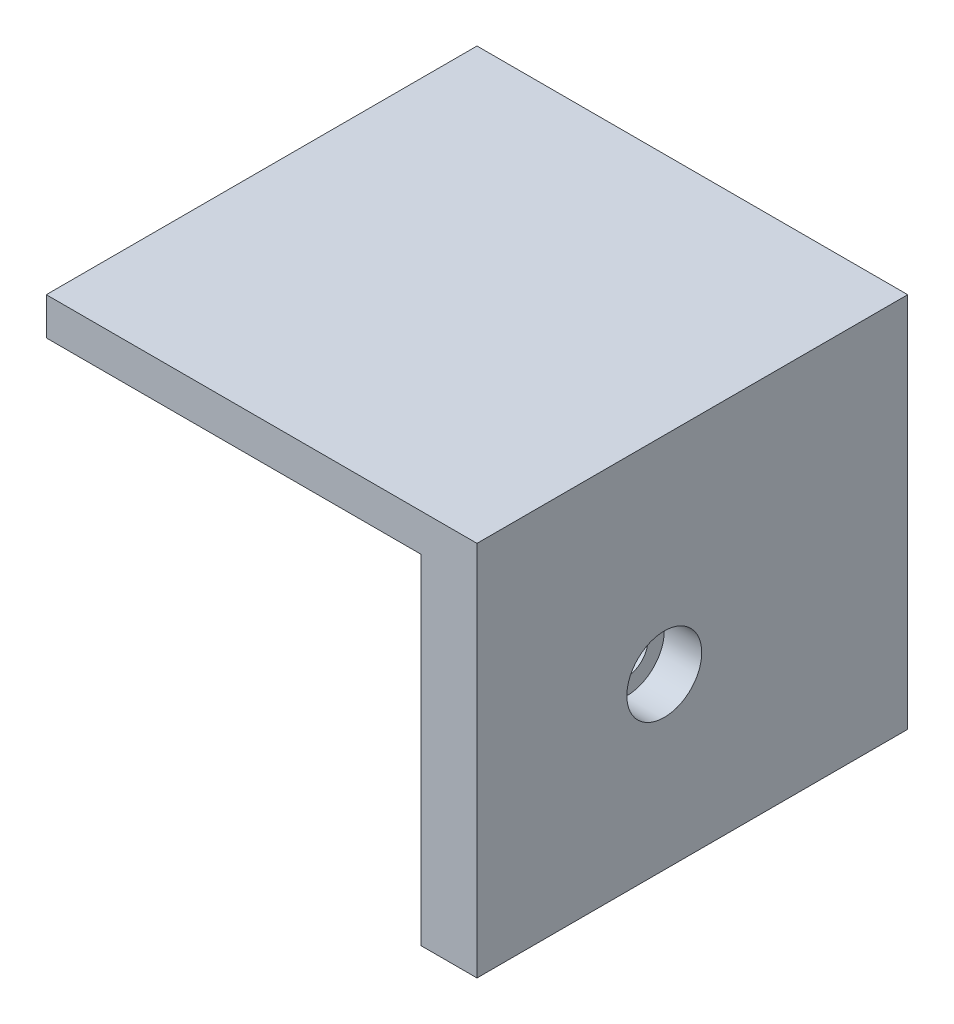
ISO-10303-21;
HEADER;
FILE_DESCRIPTION(('STEP AP214'),'2;1');
FILE_NAME('part.step','',(''),(''),'','','');
FILE_SCHEMA(('AUTOMOTIVE_DESIGN { 1 0 10303 214 1 1 1 1 }'));
ENDSEC;
DATA;
#1=APPLICATION_CONTEXT('core data for automotive mechanical design processes');
#2=APPLICATION_PROTOCOL_DEFINITION('international standard','automotive_design',2000,#1);
#3=PRODUCT_CONTEXT('',#1,'mechanical');
#4=PRODUCT('Part','Part','',(#3));
#5=PRODUCT_RELATED_PRODUCT_CATEGORY('part','',(#4));
#6=PRODUCT_DEFINITION_FORMATION('','',#4);
#7=PRODUCT_DEFINITION_CONTEXT('part definition',#1,'design');
#8=PRODUCT_DEFINITION('design','',#6,#7);
#9=PRODUCT_DEFINITION_SHAPE('','',#8);
#10=(LENGTH_UNIT() NAMED_UNIT(*) SI_UNIT(.MILLI.,.METRE.));
#11=(NAMED_UNIT(*) PLANE_ANGLE_UNIT() SI_UNIT($,.RADIAN.));
#12=(NAMED_UNIT(*) SI_UNIT($,.STERADIAN.) SOLID_ANGLE_UNIT());
#13=UNCERTAINTY_MEASURE_WITH_UNIT(LENGTH_MEASURE(1.E-05),#10,'distance_accuracy_value','');
#14=(GEOMETRIC_REPRESENTATION_CONTEXT(3) GLOBAL_UNCERTAINTY_ASSIGNED_CONTEXT((#13)) GLOBAL_UNIT_ASSIGNED_CONTEXT((#10,
#11,#12)) REPRESENTATION_CONTEXT('',''));
#15=CARTESIAN_POINT('',(0.,0.,0.));
#16=DIRECTION('',(0.,0.,1.));
#17=DIRECTION('',(1.,0.,0.));
#18=AXIS2_PLACEMENT_3D('',#15,#16,#17);
#19=CARTESIAN_POINT('',(0.,36.2,-6.));
#20=DIRECTION('',(0.,0.,1.));
#21=DIRECTION('',(1.,0.,0.));
#22=AXIS2_PLACEMENT_3D('',#19,#20,#21);
#23=PLANE('',#22);
#24=CARTESIAN_POINT('',(-20.,18.1,-6.));
#25=DIRECTION('',(0.,0.,-1.));
#26=DIRECTION('',(-1.,0.,0.));
#27=AXIS2_PLACEMENT_3D('',#24,#25,#26);
#28=CIRCLE('',#27,3.99999999999999);
#29=CARTESIAN_POINT('',(-24.,18.1,-6.));
#30=VERTEX_POINT('',#29);
#31=EDGE_CURVE('E189',#30,#30,#28,.T.);
#32=ORIENTED_EDGE('',*,*,#31,.F.);
#33=EDGE_LOOP('',(#32));
#34=FACE_BOUND('',#33,.T.);
#35=DIRECTION('',(1.,0.,0.));
#36=VECTOR('',#35,1.);
#37=CARTESIAN_POINT('',(0.,0.,-6.));
#38=LINE('',#37,#36);
#39=CARTESIAN_POINT('',(6.,0.,-6.));
#40=VERTEX_POINT('',#39);
#41=CARTESIAN_POINT('',(-40.,0.,-6.));
#42=VERTEX_POINT('',#41);
#43=EDGE_CURVE('E108',#40,#42,#38,.F.);
#44=ORIENTED_EDGE('',*,*,#43,.T.);
#45=DIRECTION('',(0.,-1.,0.));
#46=VECTOR('',#45,1.);
#47=CARTESIAN_POINT('',(-40.,36.2,-6.));
#48=LINE('',#47,#46);
#49=CARTESIAN_POINT('',(-40.,40.2,-5.99999999999999));
#50=VERTEX_POINT('',#49);
#51=EDGE_CURVE('E11',#50,#42,#48,.T.);
#52=ORIENTED_EDGE('',*,*,#51,.F.);
#53=DIRECTION('',(-1.,0.,0.));
#54=VECTOR('',#53,1.);
#55=CARTESIAN_POINT('',(6.,40.2,-6.));
#56=LINE('',#55,#54);
#57=CARTESIAN_POINT('',(6.,40.2,-6.));
#58=VERTEX_POINT('',#57);
#59=EDGE_CURVE('E172',#58,#50,#56,.T.);
#60=ORIENTED_EDGE('',*,*,#59,.F.);
#61=DIRECTION('',(0.,-1.,0.));
#62=VECTOR('',#61,1.);
#63=CARTESIAN_POINT('',(6.,36.2,-6.));
#64=LINE('',#63,#62);
#65=EDGE_CURVE('E98',#58,#40,#64,.T.);
#66=ORIENTED_EDGE('',*,*,#65,.T.);
#67=EDGE_LOOP('',(#44,#52,#60,#66));
#68=FACE_BOUND('',#67,.T.);
#69=ADVANCED_FACE('F45',(#34,#68),#23,.F.);
#70=CARTESIAN_POINT('',(-40.,36.2,0.));
#71=DIRECTION('',(-1.,0.,0.));
#72=DIRECTION('',(0.,0.,1.));
#73=AXIS2_PLACEMENT_3D('',#70,#71,#72);
#74=PLANE('',#73);
#75=DIRECTION('',(0.,0.,-1.));
#76=VECTOR('',#75,1.);
#77=CARTESIAN_POINT('',(-40.,0.,0.));
#78=LINE('',#77,#76);
#79=CARTESIAN_POINT('',(-40.,0.,0.));
#80=VERTEX_POINT('',#79);
#81=EDGE_CURVE('E139',#80,#42,#78,.T.);
#82=ORIENTED_EDGE('',*,*,#81,.F.);
#83=DIRECTION('',(0.,-1.,0.));
#84=VECTOR('',#83,1.);
#85=CARTESIAN_POINT('',(-40.,36.2,0.));
#86=LINE('',#85,#84);
#87=CARTESIAN_POINT('',(-40.,36.2,0.));
#88=VERTEX_POINT('',#87);
#89=EDGE_CURVE('E54',#88,#80,#86,.T.);
#90=ORIENTED_EDGE('',*,*,#89,.F.);
#91=DIRECTION('',(0.,0.,1.));
#92=VECTOR('',#91,1.);
#93=CARTESIAN_POINT('',(-40.,36.2,-5.99999999999999));
#94=LINE('',#93,#92);
#95=CARTESIAN_POINT('',(-40.,36.2,40.));
#96=VERTEX_POINT('',#95);
#97=EDGE_CURVE('E162',#88,#96,#94,.T.);
#98=ORIENTED_EDGE('',*,*,#97,.T.);
#99=DIRECTION('',(0.,-1.,0.));
#100=VECTOR('',#99,1.);
#101=CARTESIAN_POINT('',(-40.,40.2,40.));
#102=LINE('',#101,#100);
#103=CARTESIAN_POINT('',(-40.,40.2,40.));
#104=VERTEX_POINT('',#103);
#105=EDGE_CURVE('E149',#104,#96,#102,.T.);
#106=ORIENTED_EDGE('',*,*,#105,.F.);
#107=DIRECTION('',(0.,0.,1.));
#108=VECTOR('',#107,1.);
#109=CARTESIAN_POINT('',(-40.,40.2,-5.99999999999999));
#110=LINE('',#109,#108);
#111=EDGE_CURVE('E168',#50,#104,#110,.T.);
#112=ORIENTED_EDGE('',*,*,#111,.F.);
#113=ORIENTED_EDGE('',*,*,#51,.T.);
#114=EDGE_LOOP('',(#82,#90,#98,#106,#112,#113));
#115=FACE_BOUND('',#114,.T.);
#116=ADVANCED_FACE('F140',(#115),#74,.T.);
#117=CARTESIAN_POINT('',(0.,36.2,0.));
#118=DIRECTION('',(0.,0.,1.));
#119=DIRECTION('',(1.,0.,0.));
#120=AXIS2_PLACEMENT_3D('',#117,#118,#119);
#121=PLANE('',#120);
#122=CARTESIAN_POINT('',(-20.,18.1,0.));
#123=DIRECTION('',(0.,0.,1.));
#124=DIRECTION('',(1.,0.,0.));
#125=AXIS2_PLACEMENT_3D('',#122,#123,#124);
#126=CIRCLE('',#125,2.25);
#127=CARTESIAN_POINT('',(-17.75,18.1,0.));
#128=VERTEX_POINT('',#127);
#129=EDGE_CURVE('E165',#128,#128,#126,.T.);
#130=ORIENTED_EDGE('',*,*,#129,.F.);
#131=EDGE_LOOP('',(#130));
#132=FACE_BOUND('',#131,.T.);
#133=DIRECTION('',(-1.,0.,0.));
#134=VECTOR('',#133,1.);
#135=CARTESIAN_POINT('',(0.,0.,0.));
#136=LINE('',#135,#134);
#137=CARTESIAN_POINT('',(0.,0.,0.));
#138=VERTEX_POINT('',#137);
#139=EDGE_CURVE('E119',#138,#80,#136,.T.);
#140=ORIENTED_EDGE('',*,*,#139,.F.);
#141=DIRECTION('',(0.,-1.,0.));
#142=VECTOR('',#141,1.);
#143=CARTESIAN_POINT('',(0.,36.2,0.));
#144=LINE('',#143,#142);
#145=CARTESIAN_POINT('',(0.,36.2,0.));
#146=VERTEX_POINT('',#145);
#147=EDGE_CURVE('E128',#146,#138,#144,.T.);
#148=ORIENTED_EDGE('',*,*,#147,.F.);
#149=DIRECTION('',(-1.,0.,0.));
#150=VECTOR('',#149,1.);
#151=CARTESIAN_POINT('',(0.,36.2,0.));
#152=LINE('',#151,#150);
#153=EDGE_CURVE('E61',#146,#88,#152,.T.);
#154=ORIENTED_EDGE('',*,*,#153,.T.);
#155=ORIENTED_EDGE('',*,*,#89,.T.);
#156=EDGE_LOOP('',(#140,#148,#154,#155));
#157=FACE_BOUND('',#156,.T.);
#158=ADVANCED_FACE('F135',(#132,#157),#121,.T.);
#159=CARTESIAN_POINT('',(0.,36.2,0.));
#160=DIRECTION('',(-1.,0.,0.));
#161=DIRECTION('',(0.,0.,1.));
#162=AXIS2_PLACEMENT_3D('',#159,#160,#161);
#163=PLANE('',#162);
#164=CARTESIAN_POINT('',(0.,18.1,20.));
#165=DIRECTION('',(-1.,0.,0.));
#166=DIRECTION('',(0.,0.,1.));
#167=AXIS2_PLACEMENT_3D('',#164,#165,#166);
#168=CIRCLE('',#167,2.25);
#169=CARTESIAN_POINT('',(0.,18.1,22.25));
#170=VERTEX_POINT('',#169);
#171=EDGE_CURVE('E193',#170,#170,#168,.T.);
#172=ORIENTED_EDGE('',*,*,#171,.F.);
#173=EDGE_LOOP('',(#172));
#174=FACE_BOUND('',#173,.T.);
#175=DIRECTION('',(0.,0.,-1.));
#176=VECTOR('',#175,1.);
#177=CARTESIAN_POINT('',(0.,0.,0.));
#178=LINE('',#177,#176);
#179=CARTESIAN_POINT('',(0.,0.,40.));
#180=VERTEX_POINT('',#179);
#181=EDGE_CURVE('E116',#180,#138,#178,.T.);
#182=ORIENTED_EDGE('',*,*,#181,.F.);
#183=DIRECTION('',(0.,-1.,0.));
#184=VECTOR('',#183,1.);
#185=CARTESIAN_POINT('',(0.,36.2,40.));
#186=LINE('',#185,#184);
#187=CARTESIAN_POINT('',(0.,36.2,40.));
#188=VERTEX_POINT('',#187);
#189=EDGE_CURVE('E97',#188,#180,#186,.T.);
#190=ORIENTED_EDGE('',*,*,#189,.F.);
#191=DIRECTION('',(0.,0.,-1.));
#192=VECTOR('',#191,1.);
#193=CARTESIAN_POINT('',(0.,36.2,0.));
#194=LINE('',#193,#192);
#195=EDGE_CURVE('E124',#188,#146,#194,.T.);
#196=ORIENTED_EDGE('',*,*,#195,.T.);
#197=ORIENTED_EDGE('',*,*,#147,.T.);
#198=EDGE_LOOP('',(#182,#190,#196,#197));
#199=FACE_BOUND('',#198,.T.);
#200=ADVANCED_FACE('F222',(#174,#199),#163,.T.);
#201=CARTESIAN_POINT('',(6.00000000000001,36.2,40.));
#202=DIRECTION('',(0.,0.,1.));
#203=DIRECTION('',(1.,0.,0.));
#204=AXIS2_PLACEMENT_3D('',#201,#202,#203);
#205=PLANE('',#204);
#206=DIRECTION('',(-1.,0.,0.));
#207=VECTOR('',#206,1.);
#208=CARTESIAN_POINT('',(6.00000000000001,0.,40.));
#209=LINE('',#208,#207);
#210=CARTESIAN_POINT('',(6.00000000000001,0.,40.));
#211=VERTEX_POINT('',#210);
#212=EDGE_CURVE('E105',#211,#180,#209,.T.);
#213=ORIENTED_EDGE('',*,*,#212,.F.);
#214=DIRECTION('',(0.,-1.,0.));
#215=VECTOR('',#214,1.);
#216=CARTESIAN_POINT('',(6.00000000000001,36.2,40.));
#217=LINE('',#216,#215);
#218=CARTESIAN_POINT('',(6.,40.2,40.));
#219=VERTEX_POINT('',#218);
#220=EDGE_CURVE('E83',#219,#211,#217,.T.);
#221=ORIENTED_EDGE('',*,*,#220,.F.);
#222=DIRECTION('',(1.,0.,0.));
#223=VECTOR('',#222,1.);
#224=CARTESIAN_POINT('',(6.,40.2,40.));
#225=LINE('',#224,#223);
#226=EDGE_CURVE('E158',#104,#219,#225,.T.);
#227=ORIENTED_EDGE('',*,*,#226,.F.);
#228=ORIENTED_EDGE('',*,*,#105,.T.);
#229=DIRECTION('',(1.,0.,0.));
#230=VECTOR('',#229,1.);
#231=CARTESIAN_POINT('',(6.,36.2,40.));
#232=LINE('',#231,#230);
#233=EDGE_CURVE('E159',#96,#188,#232,.T.);
#234=ORIENTED_EDGE('',*,*,#233,.T.);
#235=ORIENTED_EDGE('',*,*,#189,.T.);
#236=EDGE_LOOP('',(#213,#221,#227,#228,#234,#235));
#237=FACE_BOUND('',#236,.T.);
#238=ADVANCED_FACE('F111',(#237),#205,.T.);
#239=CARTESIAN_POINT('',(6.,36.2,0.));
#240=DIRECTION('',(-1.,0.,0.));
#241=DIRECTION('',(0.,0.,1.));
#242=AXIS2_PLACEMENT_3D('',#239,#240,#241);
#243=PLANE('',#242);
#244=CARTESIAN_POINT('',(6.,18.1,20.));
#245=DIRECTION('',(1.,0.,0.));
#246=DIRECTION('',(0.,0.,-1.));
#247=AXIS2_PLACEMENT_3D('',#244,#245,#246);
#248=CIRCLE('',#247,3.99999999999999);
#249=CARTESIAN_POINT('',(6.,18.1,16.));
#250=VERTEX_POINT('',#249);
#251=EDGE_CURVE('E205',#250,#250,#248,.T.);
#252=ORIENTED_EDGE('',*,*,#251,.F.);
#253=EDGE_LOOP('',(#252));
#254=FACE_BOUND('',#253,.T.);
#255=DIRECTION('',(0.,0.,-1.));
#256=VECTOR('',#255,1.);
#257=CARTESIAN_POINT('',(6.,0.,0.));
#258=LINE('',#257,#256);
#259=EDGE_CURVE('E87',#211,#40,#258,.T.);
#260=ORIENTED_EDGE('',*,*,#259,.T.);
#261=ORIENTED_EDGE('',*,*,#65,.F.);
#262=DIRECTION('',(0.,0.,-1.));
#263=VECTOR('',#262,1.);
#264=CARTESIAN_POINT('',(6.,40.2,-6.));
#265=LINE('',#264,#263);
#266=EDGE_CURVE('E91',#219,#58,#265,.T.);
#267=ORIENTED_EDGE('',*,*,#266,.F.);
#268=ORIENTED_EDGE('',*,*,#220,.T.);
#269=EDGE_LOOP('',(#260,#261,#267,#268));
#270=FACE_BOUND('',#269,.T.);
#271=ADVANCED_FACE('F85',(#254,#270),#243,.F.);
#272=CARTESIAN_POINT('',(0.,0.,0.));
#273=DIRECTION('',(0.,1.,0.));
#274=DIRECTION('',(1.,0.,0.));
#275=AXIS2_PLACEMENT_3D('',#272,#273,#274);
#276=PLANE('',#275);
#277=ORIENTED_EDGE('',*,*,#43,.F.);
#278=ORIENTED_EDGE('',*,*,#259,.F.);
#279=ORIENTED_EDGE('',*,*,#212,.T.);
#280=ORIENTED_EDGE('',*,*,#181,.T.);
#281=ORIENTED_EDGE('',*,*,#139,.T.);
#282=ORIENTED_EDGE('',*,*,#81,.T.);
#283=EDGE_LOOP('',(#277,#278,#279,#280,#281,#282));
#284=FACE_BOUND('',#283,.T.);
#285=ADVANCED_FACE('F103',(#284),#276,.F.);
#286=CARTESIAN_POINT('',(0.,36.2,0.));
#287=DIRECTION('',(0.,-1.,0.));
#288=DIRECTION('',(0.,0.,-1.));
#289=AXIS2_PLACEMENT_3D('',#286,#287,#288);
#290=PLANE('',#289);
#291=ORIENTED_EDGE('',*,*,#153,.F.);
#292=ORIENTED_EDGE('',*,*,#195,.F.);
#293=ORIENTED_EDGE('',*,*,#233,.F.);
#294=ORIENTED_EDGE('',*,*,#97,.F.);
#295=EDGE_LOOP('',(#291,#292,#293,#294));
#296=FACE_BOUND('',#295,.T.);
#297=ADVANCED_FACE('F219',(#296),#290,.T.);
#298=CARTESIAN_POINT('',(0.,40.2,0.));
#299=DIRECTION('',(0.,-1.,0.));
#300=DIRECTION('',(0.,0.,-1.));
#301=AXIS2_PLACEMENT_3D('',#298,#299,#300);
#302=PLANE('',#301);
#303=ORIENTED_EDGE('',*,*,#266,.T.);
#304=ORIENTED_EDGE('',*,*,#59,.T.);
#305=ORIENTED_EDGE('',*,*,#111,.T.);
#306=ORIENTED_EDGE('',*,*,#226,.T.);
#307=EDGE_LOOP('',(#303,#304,#305,#306));
#308=FACE_BOUND('',#307,.T.);
#309=ADVANCED_FACE('F247',(#308),#302,.F.);
#310=CARTESIAN_POINT('',(-20.,18.1,-6.));
#311=DIRECTION('',(0.,0.,-1.));
#312=DIRECTION('',(-1.,0.,0.));
#313=AXIS2_PLACEMENT_3D('',#310,#311,#312);
#314=CYLINDRICAL_SURFACE('',#313,2.25);
#315=CARTESIAN_POINT('',(-20.,18.1,-2.));
#316=DIRECTION('',(0.,0.,-1.));
#317=DIRECTION('',(-1.,0.,0.));
#318=AXIS2_PLACEMENT_3D('',#315,#316,#317);
#319=CIRCLE('',#318,2.25);
#320=CARTESIAN_POINT('',(-22.25,18.1,-2.));
#321=VERTEX_POINT('',#320);
#322=EDGE_CURVE('E181',#321,#321,#319,.T.);
#323=ORIENTED_EDGE('',*,*,#322,.T.);
#324=EDGE_LOOP('',(#323));
#325=FACE_BOUND('',#324,.T.);
#326=ORIENTED_EDGE('',*,*,#129,.T.);
#327=EDGE_LOOP('',(#326));
#328=FACE_BOUND('',#327,.T.);
#329=ADVANCED_FACE('F248',(#325,#328),#314,.F.);
#330=CARTESIAN_POINT('',(-17.75,18.1,-2.));
#331=DIRECTION('',(0.,0.,1.));
#332=DIRECTION('',(1.,0.,0.));
#333=AXIS2_PLACEMENT_3D('',#330,#331,#332);
#334=PLANE('',#333);
#335=ORIENTED_EDGE('',*,*,#322,.F.);
#336=EDGE_LOOP('',(#335));
#337=FACE_BOUND('',#336,.T.);
#338=CARTESIAN_POINT('',(-20.,18.1,-2.));
#339=DIRECTION('',(0.,0.,-1.));
#340=DIRECTION('',(-1.,0.,0.));
#341=AXIS2_PLACEMENT_3D('',#338,#339,#340);
#342=CIRCLE('',#341,4.);
#343=CARTESIAN_POINT('',(-24.,18.1,-2.));
#344=VERTEX_POINT('',#343);
#345=EDGE_CURVE('E185',#344,#344,#342,.T.);
#346=ORIENTED_EDGE('',*,*,#345,.T.);
#347=EDGE_LOOP('',(#346));
#348=FACE_BOUND('',#347,.T.);
#349=ADVANCED_FACE('F253',(#337,#348),#334,.F.);
#350=CARTESIAN_POINT('',(-20.,18.1,-6.));
#351=DIRECTION('',(0.,0.,-1.));
#352=DIRECTION('',(-1.,0.,0.));
#353=AXIS2_PLACEMENT_3D('',#350,#351,#352);
#354=CYLINDRICAL_SURFACE('',#353,3.99999999999999);
#355=ORIENTED_EDGE('',*,*,#345,.F.);
#356=EDGE_LOOP('',(#355));
#357=FACE_BOUND('',#356,.T.);
#358=ORIENTED_EDGE('',*,*,#31,.T.);
#359=EDGE_LOOP('',(#358));
#360=FACE_BOUND('',#359,.T.);
#361=ADVANCED_FACE('F260',(#357,#360),#354,.F.);
#362=CARTESIAN_POINT('',(6.,18.1,20.));
#363=DIRECTION('',(1.,0.,0.));
#364=DIRECTION('',(0.,0.,-1.));
#365=AXIS2_PLACEMENT_3D('',#362,#363,#364);
#366=CYLINDRICAL_SURFACE('',#365,2.25);
#367=CARTESIAN_POINT('',(2.,18.1,20.));
#368=DIRECTION('',(1.,0.,0.));
#369=DIRECTION('',(0.,0.,-1.));
#370=AXIS2_PLACEMENT_3D('',#367,#368,#369);
#371=CIRCLE('',#370,2.25);
#372=CARTESIAN_POINT('',(2.,18.1,17.75));
#373=VERTEX_POINT('',#372);
#374=EDGE_CURVE('E197',#373,#373,#371,.T.);
#375=ORIENTED_EDGE('',*,*,#374,.T.);
#376=EDGE_LOOP('',(#375));
#377=FACE_BOUND('',#376,.T.);
#378=ORIENTED_EDGE('',*,*,#171,.T.);
#379=EDGE_LOOP('',(#378));
#380=FACE_BOUND('',#379,.T.);
#381=ADVANCED_FACE('F264',(#377,#380),#366,.F.);
#382=CARTESIAN_POINT('',(2.,20.35,20.));
#383=DIRECTION('',(-1.,0.,0.));
#384=DIRECTION('',(0.,0.,1.));
#385=AXIS2_PLACEMENT_3D('',#382,#383,#384);
#386=PLANE('',#385);
#387=ORIENTED_EDGE('',*,*,#374,.F.);
#388=EDGE_LOOP('',(#387));
#389=FACE_BOUND('',#388,.T.);
#390=CARTESIAN_POINT('',(2.,18.1,20.));
#391=DIRECTION('',(1.,0.,0.));
#392=DIRECTION('',(0.,0.,-1.));
#393=AXIS2_PLACEMENT_3D('',#390,#391,#392);
#394=CIRCLE('',#393,4.);
#395=CARTESIAN_POINT('',(2.,18.1,16.));
#396=VERTEX_POINT('',#395);
#397=EDGE_CURVE('E201',#396,#396,#394,.T.);
#398=ORIENTED_EDGE('',*,*,#397,.T.);
#399=EDGE_LOOP('',(#398));
#400=FACE_BOUND('',#399,.T.);
#401=ADVANCED_FACE('F268',(#389,#400),#386,.F.);
#402=CARTESIAN_POINT('',(6.,18.1,20.));
#403=DIRECTION('',(1.,0.,0.));
#404=DIRECTION('',(0.,0.,-1.));
#405=AXIS2_PLACEMENT_3D('',#402,#403,#404);
#406=CYLINDRICAL_SURFACE('',#405,3.99999999999999);
#407=ORIENTED_EDGE('',*,*,#397,.F.);
#408=EDGE_LOOP('',(#407));
#409=FACE_BOUND('',#408,.T.);
#410=ORIENTED_EDGE('',*,*,#251,.T.);
#411=EDGE_LOOP('',(#410));
#412=FACE_BOUND('',#411,.T.);
#413=ADVANCED_FACE('F210',(#409,#412),#406,.F.);
#414=CLOSED_SHELL('',(#69,#116,#158,#200,#238,#271,#285,#297,#309,#329,#349,#361,#381,#401,#413));
#415=MANIFOLD_SOLID_BREP('B2',#414);
#416=ADVANCED_BREP_SHAPE_REPRESENTATION('',(#18,#415),#14);
#417=SHAPE_DEFINITION_REPRESENTATION(#9,#416);
ENDSEC;
END-ISO-10303-21;
